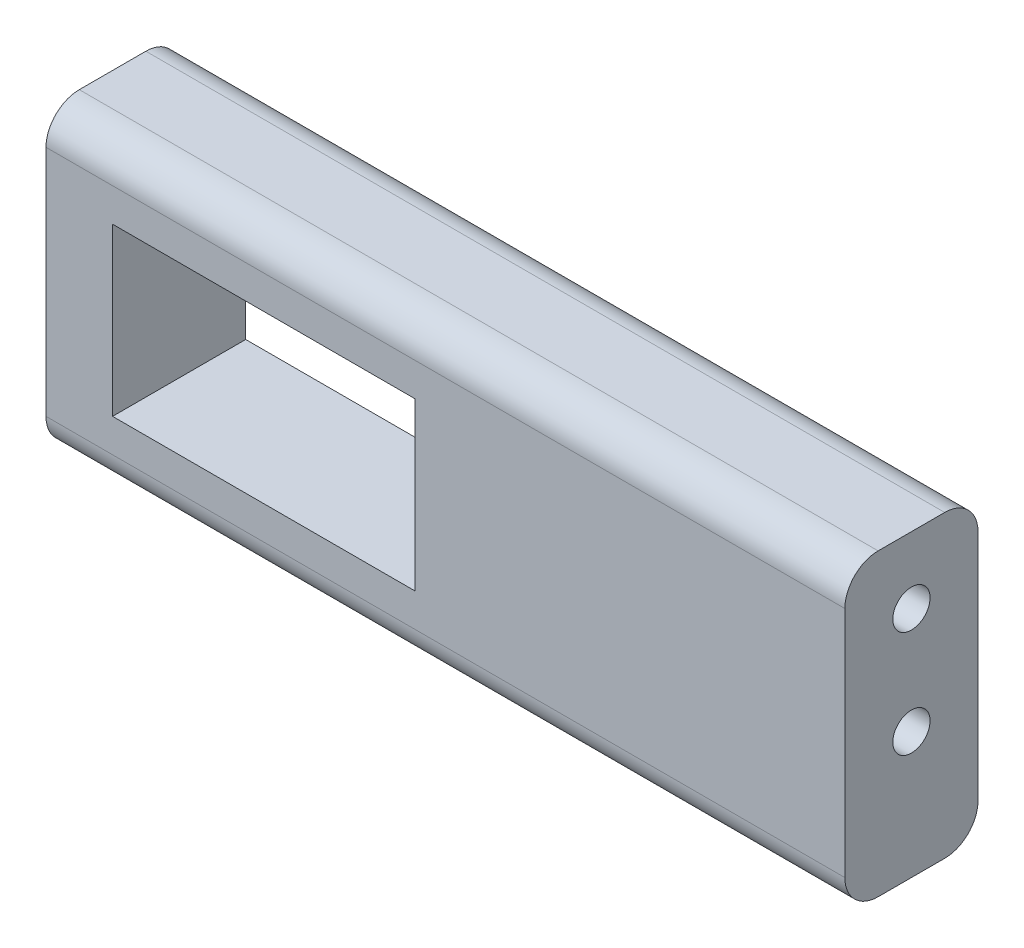
ISO-10303-21;
HEADER;
FILE_DESCRIPTION(('STEP AP214'),'2;1');
FILE_NAME('part.step','',(''),(''),'','','');
FILE_SCHEMA(('AUTOMOTIVE_DESIGN { 1 0 10303 214 1 1 1 1 }'));
ENDSEC;
DATA;
#1=APPLICATION_CONTEXT('core data for automotive mechanical design processes');
#2=APPLICATION_PROTOCOL_DEFINITION('international standard','automotive_design',2000,#1);
#3=PRODUCT_CONTEXT('',#1,'mechanical');
#4=PRODUCT('Part','Part','',(#3));
#5=PRODUCT_RELATED_PRODUCT_CATEGORY('part','',(#4));
#6=PRODUCT_DEFINITION_FORMATION('','',#4);
#7=PRODUCT_DEFINITION_CONTEXT('part definition',#1,'design');
#8=PRODUCT_DEFINITION('design','',#6,#7);
#9=PRODUCT_DEFINITION_SHAPE('','',#8);
#10=(LENGTH_UNIT() NAMED_UNIT(*) SI_UNIT(.MILLI.,.METRE.));
#11=(NAMED_UNIT(*) PLANE_ANGLE_UNIT() SI_UNIT($,.RADIAN.));
#12=(NAMED_UNIT(*) SI_UNIT($,.STERADIAN.) SOLID_ANGLE_UNIT());
#13=UNCERTAINTY_MEASURE_WITH_UNIT(LENGTH_MEASURE(1.E-05),#10,'distance_accuracy_value','');
#14=(GEOMETRIC_REPRESENTATION_CONTEXT(3) GLOBAL_UNCERTAINTY_ASSIGNED_CONTEXT((#13)) GLOBAL_UNIT_ASSIGNED_CONTEXT((#10,
#11,#12)) REPRESENTATION_CONTEXT('',''));
#15=CARTESIAN_POINT('',(0.,0.,0.));
#16=DIRECTION('',(0.,0.,1.));
#17=DIRECTION('',(1.,0.,0.));
#18=AXIS2_PLACEMENT_3D('',#15,#16,#17);
#19=CARTESIAN_POINT('',(0.,0.,10.));
#20=DIRECTION('',(0.,0.,1.));
#21=DIRECTION('',(1.,0.,0.));
#22=AXIS2_PLACEMENT_3D('',#19,#20,#21);
#23=PLANE('',#22);
#24=DIRECTION('',(0.,-1.,0.));
#25=VECTOR('',#24,1.);
#26=CARTESIAN_POINT('',(-15.2055258764608,12.7579166666667,10.));
#27=LINE('',#26,#25);
#28=CARTESIAN_POINT('',(-15.2055258764608,10.2579166666667,10.));
#29=VERTEX_POINT('',#28);
#30=CARTESIAN_POINT('',(-15.2055258764608,-7.24208333333333,10.));
#31=VERTEX_POINT('',#30);
#32=EDGE_CURVE('E167',#29,#31,#27,.T.);
#33=ORIENTED_EDGE('',*,*,#32,.T.);
#34=DIRECTION('',(1.,0.,0.));
#35=VECTOR('',#34,1.);
#36=CARTESIAN_POINT('',(44.7944741235392,-7.24208333333333,10.));
#37=LINE('',#36,#35);
#38=CARTESIAN_POINT('',(44.7944741235392,-7.24208333333333,10.));
#39=VERTEX_POINT('',#38);
#40=EDGE_CURVE('E192',#31,#39,#37,.T.);
#41=ORIENTED_EDGE('',*,*,#40,.T.);
#42=DIRECTION('',(0.,1.,0.));
#43=VECTOR('',#42,1.);
#44=CARTESIAN_POINT('',(44.7944741235392,12.7579166666667,10.));
#45=LINE('',#44,#43);
#46=CARTESIAN_POINT('',(44.7944741235392,10.2579166666667,10.));
#47=VERTEX_POINT('',#46);
#48=EDGE_CURVE('E170',#39,#47,#45,.T.);
#49=ORIENTED_EDGE('',*,*,#48,.T.);
#50=DIRECTION('',(-1.,0.,0.));
#51=VECTOR('',#50,1.);
#52=CARTESIAN_POINT('',(-15.2055258764608,10.2579166666667,10.));
#53=LINE('',#52,#51);
#54=EDGE_CURVE('E189',#47,#29,#53,.T.);
#55=ORIENTED_EDGE('',*,*,#54,.T.);
#56=EDGE_LOOP('',(#33,#41,#49,#55));
#57=FACE_BOUND('',#56,.T.);
#58=DIRECTION('',(1.,0.,0.));
#59=VECTOR('',#58,1.);
#60=CARTESIAN_POINT('',(-10.2055258764608,-4.74208333333334,10.));
#61=LINE('',#60,#59);
#62=CARTESIAN_POINT('',(-10.2055258764608,-4.74208333333334,10.));
#63=VERTEX_POINT('',#62);
#64=CARTESIAN_POINT('',(12.4944741235392,-4.74208333333333,10.));
#65=VERTEX_POINT('',#64);
#66=EDGE_CURVE('E134',#63,#65,#61,.T.);
#67=ORIENTED_EDGE('',*,*,#66,.F.);
#68=DIRECTION('',(0.,-1.,0.));
#69=VECTOR('',#68,1.);
#70=CARTESIAN_POINT('',(-10.2055258764608,7.75791666666667,10.));
#71=LINE('',#70,#69);
#72=CARTESIAN_POINT('',(-10.2055258764608,7.75791666666667,10.));
#73=VERTEX_POINT('',#72);
#74=EDGE_CURVE('E124',#73,#63,#71,.T.);
#75=ORIENTED_EDGE('',*,*,#74,.F.);
#76=DIRECTION('',(-1.,0.,0.));
#77=VECTOR('',#76,1.);
#78=CARTESIAN_POINT('',(-10.2055258764608,7.75791666666667,10.));
#79=LINE('',#78,#77);
#80=CARTESIAN_POINT('',(12.4944741235392,7.75791666666667,10.));
#81=VERTEX_POINT('',#80);
#82=EDGE_CURVE('E149',#81,#73,#79,.T.);
#83=ORIENTED_EDGE('',*,*,#82,.F.);
#84=DIRECTION('',(0.,1.,0.));
#85=VECTOR('',#84,1.);
#86=CARTESIAN_POINT('',(12.4944741235392,7.75791666666667,10.));
#87=LINE('',#86,#85);
#88=EDGE_CURVE('E147',#65,#81,#87,.T.);
#89=ORIENTED_EDGE('',*,*,#88,.F.);
#90=EDGE_LOOP('',(#67,#75,#83,#89));
#91=FACE_BOUND('',#90,.T.);
#92=ADVANCED_FACE('F33',(#57,#91),#23,.T.);
#93=CARTESIAN_POINT('',(0.,0.,0.));
#94=DIRECTION('',(0.,0.,1.));
#95=DIRECTION('',(1.,0.,0.));
#96=AXIS2_PLACEMENT_3D('',#93,#94,#95);
#97=PLANE('',#96);
#98=DIRECTION('',(0.,1.,0.));
#99=VECTOR('',#98,1.);
#100=CARTESIAN_POINT('',(44.7944741235392,12.7579166666667,0.));
#101=LINE('',#100,#99);
#102=CARTESIAN_POINT('',(44.7944741235392,-7.24208333333333,0.));
#103=VERTEX_POINT('',#102);
#104=CARTESIAN_POINT('',(44.7944741235392,10.2579166666667,0.));
#105=VERTEX_POINT('',#104);
#106=EDGE_CURVE('E171',#103,#105,#101,.T.);
#107=ORIENTED_EDGE('',*,*,#106,.F.);
#108=DIRECTION('',(1.,0.,0.));
#109=VECTOR('',#108,1.);
#110=CARTESIAN_POINT('',(0.,-7.24208333333333,0.));
#111=LINE('',#110,#109);
#112=CARTESIAN_POINT('',(-15.2055258764608,-7.24208333333333,0.));
#113=VERTEX_POINT('',#112);
#114=EDGE_CURVE('E11',#103,#113,#111,.F.);
#115=ORIENTED_EDGE('',*,*,#114,.T.);
#116=DIRECTION('',(0.,-1.,0.));
#117=VECTOR('',#116,1.);
#118=CARTESIAN_POINT('',(-15.2055258764608,12.7579166666667,0.));
#119=LINE('',#118,#117);
#120=CARTESIAN_POINT('',(-15.2055258764608,10.2579166666667,0.));
#121=VERTEX_POINT('',#120);
#122=EDGE_CURVE('E142',#121,#113,#119,.T.);
#123=ORIENTED_EDGE('',*,*,#122,.F.);
#124=DIRECTION('',(-1.,0.,0.));
#125=VECTOR('',#124,1.);
#126=CARTESIAN_POINT('',(0.,10.2579166666667,0.));
#127=LINE('',#126,#125);
#128=EDGE_CURVE('E41',#121,#105,#127,.F.);
#129=ORIENTED_EDGE('',*,*,#128,.T.);
#130=EDGE_LOOP('',(#107,#115,#123,#129));
#131=FACE_BOUND('',#130,.T.);
#132=DIRECTION('',(0.,-1.,0.));
#133=VECTOR('',#132,1.);
#134=CARTESIAN_POINT('',(-10.2055258764608,7.75791666666667,0.));
#135=LINE('',#134,#133);
#136=CARTESIAN_POINT('',(-10.2055258764608,7.75791666666667,0.));
#137=VERTEX_POINT('',#136);
#138=CARTESIAN_POINT('',(-10.2055258764608,-4.74208333333334,0.));
#139=VERTEX_POINT('',#138);
#140=EDGE_CURVE('E154',#137,#139,#135,.T.);
#141=ORIENTED_EDGE('',*,*,#140,.T.);
#142=DIRECTION('',(1.,0.,0.));
#143=VECTOR('',#142,1.);
#144=CARTESIAN_POINT('',(-10.2055258764608,-4.74208333333334,0.));
#145=LINE('',#144,#143);
#146=CARTESIAN_POINT('',(12.4944741235392,-4.74208333333333,0.));
#147=VERTEX_POINT('',#146);
#148=EDGE_CURVE('E141',#139,#147,#145,.T.);
#149=ORIENTED_EDGE('',*,*,#148,.T.);
#150=DIRECTION('',(0.,1.,0.));
#151=VECTOR('',#150,1.);
#152=CARTESIAN_POINT('',(12.4944741235392,7.75791666666667,0.));
#153=LINE('',#152,#151);
#154=CARTESIAN_POINT('',(12.4944741235392,7.75791666666667,0.));
#155=VERTEX_POINT('',#154);
#156=EDGE_CURVE('E158',#147,#155,#153,.T.);
#157=ORIENTED_EDGE('',*,*,#156,.T.);
#158=DIRECTION('',(-1.,0.,0.));
#159=VECTOR('',#158,1.);
#160=CARTESIAN_POINT('',(-10.2055258764608,7.75791666666667,0.));
#161=LINE('',#160,#159);
#162=EDGE_CURVE('E135',#155,#137,#161,.T.);
#163=ORIENTED_EDGE('',*,*,#162,.T.);
#164=EDGE_LOOP('',(#141,#149,#157,#163));
#165=FACE_BOUND('',#164,.T.);
#166=ADVANCED_FACE('F220',(#131,#165),#97,.F.);
#167=CARTESIAN_POINT('',(-15.2055258764608,12.7579166666667,10.));
#168=DIRECTION('',(1.,0.,0.));
#169=DIRECTION('',(0.,1.,0.));
#170=AXIS2_PLACEMENT_3D('',#167,#168,#169);
#171=PLANE('',#170);
#172=CARTESIAN_POINT('',(-15.2055258764608,-0.242083333333333,5.));
#173=DIRECTION('',(-1.,0.,0.));
#174=DIRECTION('',(0.,-1.,0.));
#175=AXIS2_PLACEMENT_3D('',#172,#173,#174);
#176=CIRCLE('',#175,1.4);
#177=CARTESIAN_POINT('',(-15.2055258764608,-1.64208333333333,5.));
#178=VERTEX_POINT('',#177);
#179=EDGE_CURVE('E281',#178,#178,#176,.T.);
#180=ORIENTED_EDGE('',*,*,#179,.F.);
#181=EDGE_LOOP('',(#180));
#182=FACE_BOUND('',#181,.T.);
#183=CARTESIAN_POINT('',(-15.2055258764608,7.75791666666667,5.));
#184=DIRECTION('',(-1.,0.,0.));
#185=DIRECTION('',(0.,-1.,0.));
#186=AXIS2_PLACEMENT_3D('',#183,#184,#185);
#187=CIRCLE('',#186,1.4);
#188=CARTESIAN_POINT('',(-15.2055258764608,6.35791666666667,5.));
#189=VERTEX_POINT('',#188);
#190=EDGE_CURVE('E284',#189,#189,#187,.T.);
#191=ORIENTED_EDGE('',*,*,#190,.F.);
#192=EDGE_LOOP('',(#191));
#193=FACE_BOUND('',#192,.T.);
#194=DIRECTION('',(0.,0.,-1.));
#195=VECTOR('',#194,1.);
#196=CARTESIAN_POINT('',(-15.2055258764608,-9.74208333333334,10.));
#197=LINE('',#196,#195);
#198=CARTESIAN_POINT('',(-15.2055258764608,-9.74208333333334,7.5));
#199=VERTEX_POINT('',#198);
#200=CARTESIAN_POINT('',(-15.2055258764608,-9.74208333333334,2.5));
#201=VERTEX_POINT('',#200);
#202=EDGE_CURVE('E186',#199,#201,#197,.T.);
#203=ORIENTED_EDGE('',*,*,#202,.F.);
#204=CARTESIAN_POINT('',(-15.2055258764608,-7.24208333333333,7.5));
#205=DIRECTION('',(1.,0.,0.));
#206=DIRECTION('',(0.,1.,0.));
#207=AXIS2_PLACEMENT_3D('',#204,#205,#206);
#208=CIRCLE('',#207,2.5);
#209=EDGE_CURVE('E212',#199,#31,#208,.F.);
#210=ORIENTED_EDGE('',*,*,#209,.T.);
#211=ORIENTED_EDGE('',*,*,#32,.F.);
#212=CARTESIAN_POINT('',(-15.2055258764608,10.2579166666667,7.5));
#213=DIRECTION('',(1.,0.,0.));
#214=DIRECTION('',(0.,1.,0.));
#215=AXIS2_PLACEMENT_3D('',#212,#213,#214);
#216=CIRCLE('',#215,2.5);
#217=CARTESIAN_POINT('',(-15.2055258764608,12.7579166666667,7.5));
#218=VERTEX_POINT('',#217);
#219=EDGE_CURVE('E56',#29,#218,#216,.F.);
#220=ORIENTED_EDGE('',*,*,#219,.T.);
#221=DIRECTION('',(0.,0.,-1.));
#222=VECTOR('',#221,1.);
#223=CARTESIAN_POINT('',(-15.2055258764608,12.7579166666667,10.));
#224=LINE('',#223,#222);
#225=CARTESIAN_POINT('',(-15.2055258764608,12.7579166666667,2.5));
#226=VERTEX_POINT('',#225);
#227=EDGE_CURVE('E174',#218,#226,#224,.T.);
#228=ORIENTED_EDGE('',*,*,#227,.T.);
#229=CARTESIAN_POINT('',(-15.2055258764608,10.2579166666667,2.5));
#230=DIRECTION('',(1.,0.,0.));
#231=DIRECTION('',(0.,1.,0.));
#232=AXIS2_PLACEMENT_3D('',#229,#230,#231);
#233=CIRCLE('',#232,2.5);
#234=EDGE_CURVE('E48',#226,#121,#233,.F.);
#235=ORIENTED_EDGE('',*,*,#234,.T.);
#236=ORIENTED_EDGE('',*,*,#122,.T.);
#237=CARTESIAN_POINT('',(-15.2055258764608,-7.24208333333333,2.5));
#238=DIRECTION('',(1.,0.,0.));
#239=DIRECTION('',(0.,1.,0.));
#240=AXIS2_PLACEMENT_3D('',#237,#238,#239);
#241=CIRCLE('',#240,2.5);
#242=EDGE_CURVE('E209',#113,#201,#241,.F.);
#243=ORIENTED_EDGE('',*,*,#242,.T.);
#244=EDGE_LOOP('',(#203,#210,#211,#220,#228,#235,#236,#243));
#245=FACE_BOUND('',#244,.T.);
#246=ADVANCED_FACE('F232',(#182,#193,#245),#171,.F.);
#247=CARTESIAN_POINT('',(-15.2055258764608,-9.74208333333334,10.));
#248=DIRECTION('',(0.,1.,0.));
#249=DIRECTION('',(0.,0.,1.));
#250=AXIS2_PLACEMENT_3D('',#247,#248,#249);
#251=PLANE('',#250);
#252=DIRECTION('',(0.,0.,-1.));
#253=VECTOR('',#252,1.);
#254=CARTESIAN_POINT('',(44.7944741235392,-9.74208333333334,10.));
#255=LINE('',#254,#253);
#256=CARTESIAN_POINT('',(44.7944741235392,-9.74208333333334,7.5));
#257=VERTEX_POINT('',#256);
#258=CARTESIAN_POINT('',(44.7944741235392,-9.74208333333334,2.5));
#259=VERTEX_POINT('',#258);
#260=EDGE_CURVE('E183',#257,#259,#255,.T.);
#261=ORIENTED_EDGE('',*,*,#260,.F.);
#262=DIRECTION('',(1.,0.,0.));
#263=VECTOR('',#262,1.);
#264=CARTESIAN_POINT('',(-15.2055258764608,-9.74208333333334,7.5));
#265=LINE('',#264,#263);
#266=EDGE_CURVE('E206',#257,#199,#265,.F.);
#267=ORIENTED_EDGE('',*,*,#266,.T.);
#268=ORIENTED_EDGE('',*,*,#202,.T.);
#269=DIRECTION('',(1.,0.,0.));
#270=VECTOR('',#269,1.);
#271=CARTESIAN_POINT('',(-15.2055258764608,-9.74208333333334,2.5));
#272=LINE('',#271,#270);
#273=EDGE_CURVE('E203',#201,#259,#272,.T.);
#274=ORIENTED_EDGE('',*,*,#273,.T.);
#275=EDGE_LOOP('',(#261,#267,#268,#274));
#276=FACE_BOUND('',#275,.T.);
#277=ADVANCED_FACE('F239',(#276),#251,.F.);
#278=CARTESIAN_POINT('',(44.7944741235392,12.7579166666667,10.));
#279=DIRECTION('',(-1.,0.,0.));
#280=DIRECTION('',(0.,0.,1.));
#281=AXIS2_PLACEMENT_3D('',#278,#279,#280);
#282=PLANE('',#281);
#283=CARTESIAN_POINT('',(44.7944741235392,-0.242083333333333,5.));
#284=DIRECTION('',(1.,0.,0.));
#285=DIRECTION('',(0.,0.,-1.));
#286=AXIS2_PLACEMENT_3D('',#283,#284,#285);
#287=CIRCLE('',#286,1.4);
#288=CARTESIAN_POINT('',(44.7944741235392,-0.242083333333333,3.6));
#289=VERTEX_POINT('',#288);
#290=EDGE_CURVE('E290',#289,#289,#287,.T.);
#291=ORIENTED_EDGE('',*,*,#290,.F.);
#292=EDGE_LOOP('',(#291));
#293=FACE_BOUND('',#292,.T.);
#294=CARTESIAN_POINT('',(44.7944741235392,7.75791666666667,5.));
#295=DIRECTION('',(1.,0.,0.));
#296=DIRECTION('',(0.,0.,-1.));
#297=AXIS2_PLACEMENT_3D('',#294,#295,#296);
#298=CIRCLE('',#297,1.4);
#299=CARTESIAN_POINT('',(44.7944741235392,7.75791666666667,3.6));
#300=VERTEX_POINT('',#299);
#301=EDGE_CURVE('E299',#300,#300,#298,.T.);
#302=ORIENTED_EDGE('',*,*,#301,.F.);
#303=EDGE_LOOP('',(#302));
#304=FACE_BOUND('',#303,.T.);
#305=ORIENTED_EDGE('',*,*,#48,.F.);
#306=CARTESIAN_POINT('',(44.7944741235392,-7.24208333333333,7.5));
#307=DIRECTION('',(-1.,0.,0.));
#308=DIRECTION('',(0.,0.,1.));
#309=AXIS2_PLACEMENT_3D('',#306,#307,#308);
#310=CIRCLE('',#309,2.5);
#311=EDGE_CURVE('E201',#39,#257,#310,.F.);
#312=ORIENTED_EDGE('',*,*,#311,.T.);
#313=ORIENTED_EDGE('',*,*,#260,.T.);
#314=CARTESIAN_POINT('',(44.7944741235392,-7.24208333333333,2.5));
#315=DIRECTION('',(-1.,0.,0.));
#316=DIRECTION('',(0.,0.,1.));
#317=AXIS2_PLACEMENT_3D('',#314,#315,#316);
#318=CIRCLE('',#317,2.5);
#319=EDGE_CURVE('E197',#259,#103,#318,.F.);
#320=ORIENTED_EDGE('',*,*,#319,.T.);
#321=ORIENTED_EDGE('',*,*,#106,.T.);
#322=CARTESIAN_POINT('',(44.7944741235392,10.2579166666667,2.5));
#323=DIRECTION('',(-1.,0.,0.));
#324=DIRECTION('',(0.,0.,1.));
#325=AXIS2_PLACEMENT_3D('',#322,#323,#324);
#326=CIRCLE('',#325,2.5);
#327=CARTESIAN_POINT('',(44.7944741235392,12.7579166666667,2.5));
#328=VERTEX_POINT('',#327);
#329=EDGE_CURVE('E195',#105,#328,#326,.F.);
#330=ORIENTED_EDGE('',*,*,#329,.T.);
#331=DIRECTION('',(0.,0.,-1.));
#332=VECTOR('',#331,1.);
#333=CARTESIAN_POINT('',(44.7944741235392,12.7579166666667,10.));
#334=LINE('',#333,#332);
#335=CARTESIAN_POINT('',(44.7944741235392,12.7579166666667,7.5));
#336=VERTEX_POINT('',#335);
#337=EDGE_CURVE('E180',#336,#328,#334,.T.);
#338=ORIENTED_EDGE('',*,*,#337,.F.);
#339=CARTESIAN_POINT('',(44.7944741235392,10.2579166666667,7.5));
#340=DIRECTION('',(-1.,0.,0.));
#341=DIRECTION('',(0.,0.,1.));
#342=AXIS2_PLACEMENT_3D('',#339,#340,#341);
#343=CIRCLE('',#342,2.5);
#344=EDGE_CURVE('E199',#336,#47,#343,.F.);
#345=ORIENTED_EDGE('',*,*,#344,.T.);
#346=EDGE_LOOP('',(#305,#312,#313,#320,#321,#330,#338,#345));
#347=FACE_BOUND('',#346,.T.);
#348=ADVANCED_FACE('F226',(#293,#304,#347),#282,.F.);
#349=CARTESIAN_POINT('',(-15.2055258764608,12.7579166666667,10.));
#350=DIRECTION('',(0.,-1.,0.));
#351=DIRECTION('',(0.,0.,-1.));
#352=AXIS2_PLACEMENT_3D('',#349,#350,#351);
#353=PLANE('',#352);
#354=ORIENTED_EDGE('',*,*,#227,.F.);
#355=DIRECTION('',(-1.,0.,0.));
#356=VECTOR('',#355,1.);
#357=CARTESIAN_POINT('',(44.7944741235392,12.7579166666667,7.5));
#358=LINE('',#357,#356);
#359=EDGE_CURVE('E216',#218,#336,#358,.F.);
#360=ORIENTED_EDGE('',*,*,#359,.T.);
#361=ORIENTED_EDGE('',*,*,#337,.T.);
#362=DIRECTION('',(-1.,0.,0.));
#363=VECTOR('',#362,1.);
#364=CARTESIAN_POINT('',(-15.2055258764608,12.7579166666667,2.5));
#365=LINE('',#364,#363);
#366=EDGE_CURVE('E214',#328,#226,#365,.T.);
#367=ORIENTED_EDGE('',*,*,#366,.T.);
#368=EDGE_LOOP('',(#354,#360,#361,#367));
#369=FACE_BOUND('',#368,.T.);
#370=ADVANCED_FACE('F229',(#369),#353,.F.);
#371=CARTESIAN_POINT('',(-10.2055258764608,7.75791666666667,10.));
#372=DIRECTION('',(1.,0.,0.));
#373=DIRECTION('',(0.,1.,0.));
#374=AXIS2_PLACEMENT_3D('',#371,#372,#373);
#375=PLANE('',#374);
#376=ORIENTED_EDGE('',*,*,#140,.F.);
#377=DIRECTION('',(0.,0.,-1.));
#378=VECTOR('',#377,1.);
#379=CARTESIAN_POINT('',(-10.2055258764608,7.75791666666667,10.));
#380=LINE('',#379,#378);
#381=EDGE_CURVE('E130',#73,#137,#380,.T.);
#382=ORIENTED_EDGE('',*,*,#381,.F.);
#383=ORIENTED_EDGE('',*,*,#74,.T.);
#384=DIRECTION('',(0.,0.,-1.));
#385=VECTOR('',#384,1.);
#386=CARTESIAN_POINT('',(-10.2055258764608,-4.74208333333334,10.));
#387=LINE('',#386,#385);
#388=EDGE_CURVE('E127',#63,#139,#387,.T.);
#389=ORIENTED_EDGE('',*,*,#388,.T.);
#390=EDGE_LOOP('',(#376,#382,#383,#389));
#391=FACE_BOUND('',#390,.T.);
#392=ADVANCED_FACE('F126',(#391),#375,.T.);
#393=CARTESIAN_POINT('',(-10.2055258764608,-4.74208333333334,10.));
#394=DIRECTION('',(0.,1.,0.));
#395=DIRECTION('',(-1.,0.,0.));
#396=AXIS2_PLACEMENT_3D('',#393,#394,#395);
#397=PLANE('',#396);
#398=ORIENTED_EDGE('',*,*,#148,.F.);
#399=ORIENTED_EDGE('',*,*,#388,.F.);
#400=ORIENTED_EDGE('',*,*,#66,.T.);
#401=DIRECTION('',(0.,0.,-1.));
#402=VECTOR('',#401,1.);
#403=CARTESIAN_POINT('',(12.4944741235392,-4.74208333333333,10.));
#404=LINE('',#403,#402);
#405=EDGE_CURVE('E143',#65,#147,#404,.T.);
#406=ORIENTED_EDGE('',*,*,#405,.T.);
#407=EDGE_LOOP('',(#398,#399,#400,#406));
#408=FACE_BOUND('',#407,.T.);
#409=ADVANCED_FACE('F138',(#408),#397,.T.);
#410=CARTESIAN_POINT('',(12.4944741235392,7.75791666666667,10.));
#411=DIRECTION('',(-1.,0.,0.));
#412=DIRECTION('',(0.,-1.,0.));
#413=AXIS2_PLACEMENT_3D('',#410,#411,#412);
#414=PLANE('',#413);
#415=ORIENTED_EDGE('',*,*,#156,.F.);
#416=ORIENTED_EDGE('',*,*,#405,.F.);
#417=ORIENTED_EDGE('',*,*,#88,.T.);
#418=DIRECTION('',(0.,0.,-1.));
#419=VECTOR('',#418,1.);
#420=CARTESIAN_POINT('',(12.4944741235392,7.75791666666667,10.));
#421=LINE('',#420,#419);
#422=EDGE_CURVE('E164',#81,#155,#421,.T.);
#423=ORIENTED_EDGE('',*,*,#422,.T.);
#424=EDGE_LOOP('',(#415,#416,#417,#423));
#425=FACE_BOUND('',#424,.T.);
#426=ADVANCED_FACE('F320',(#425),#414,.T.);
#427=CARTESIAN_POINT('',(-10.2055258764608,7.75791666666667,10.));
#428=DIRECTION('',(0.,-1.,0.));
#429=DIRECTION('',(1.,0.,0.));
#430=AXIS2_PLACEMENT_3D('',#427,#428,#429);
#431=PLANE('',#430);
#432=ORIENTED_EDGE('',*,*,#162,.F.);
#433=ORIENTED_EDGE('',*,*,#422,.F.);
#434=ORIENTED_EDGE('',*,*,#82,.T.);
#435=ORIENTED_EDGE('',*,*,#381,.T.);
#436=EDGE_LOOP('',(#432,#433,#434,#435));
#437=FACE_BOUND('',#436,.T.);
#438=ADVANCED_FACE('F310',(#437),#431,.T.);
#439=CARTESIAN_POINT('',(24.7944741235392,7.75791666666667,5.));
#440=DIRECTION('',(1.,0.,0.));
#441=DIRECTION('',(0.,0.,-1.));
#442=AXIS2_PLACEMENT_3D('',#439,#440,#441);
#443=CYLINDRICAL_SURFACE('',#442,1.4);
#444=CARTESIAN_POINT('',(24.7944741235392,7.75791666666667,5.));
#445=DIRECTION('',(1.,0.,0.));
#446=DIRECTION('',(0.,0.,-1.));
#447=AXIS2_PLACEMENT_3D('',#444,#445,#446);
#448=CIRCLE('',#447,1.4);
#449=CARTESIAN_POINT('',(24.7944741235392,7.75791666666667,3.6));
#450=VERTEX_POINT('',#449);
#451=EDGE_CURVE('E156',#450,#450,#448,.T.);
#452=ORIENTED_EDGE('',*,*,#451,.F.);
#453=EDGE_LOOP('',(#452));
#454=FACE_BOUND('',#453,.T.);
#455=ORIENTED_EDGE('',*,*,#301,.T.);
#456=EDGE_LOOP('',(#455));
#457=FACE_BOUND('',#456,.T.);
#458=ADVANCED_FACE('F306',(#454,#457),#443,.F.);
#459=CARTESIAN_POINT('',(24.7944741235392,7.75791666666667,5.));
#460=DIRECTION('',(1.,0.,0.));
#461=DIRECTION('',(0.,0.,-1.));
#462=AXIS2_PLACEMENT_3D('',#459,#460,#461);
#463=PLANE('',#462);
#464=ORIENTED_EDGE('',*,*,#451,.T.);
#465=EDGE_LOOP('',(#464));
#466=FACE_BOUND('',#465,.T.);
#467=ADVANCED_FACE('F309',(#466),#463,.T.);
#468=CARTESIAN_POINT('',(24.7944741235392,-0.242083333333333,5.));
#469=DIRECTION('',(1.,0.,0.));
#470=DIRECTION('',(0.,0.,-1.));
#471=AXIS2_PLACEMENT_3D('',#468,#469,#470);
#472=CYLINDRICAL_SURFACE('',#471,1.4);
#473=CARTESIAN_POINT('',(24.7944741235392,-0.242083333333333,5.));
#474=DIRECTION('',(1.,0.,0.));
#475=DIRECTION('',(0.,0.,-1.));
#476=AXIS2_PLACEMENT_3D('',#473,#474,#475);
#477=CIRCLE('',#476,1.4);
#478=CARTESIAN_POINT('',(24.7944741235392,-0.242083333333333,3.6));
#479=VERTEX_POINT('',#478);
#480=EDGE_CURVE('E296',#479,#479,#477,.T.);
#481=ORIENTED_EDGE('',*,*,#480,.F.);
#482=EDGE_LOOP('',(#481));
#483=FACE_BOUND('',#482,.T.);
#484=ORIENTED_EDGE('',*,*,#290,.T.);
#485=EDGE_LOOP('',(#484));
#486=FACE_BOUND('',#485,.T.);
#487=ADVANCED_FACE('F317',(#483,#486),#472,.F.);
#488=CARTESIAN_POINT('',(24.7944741235392,-0.242083333333333,5.));
#489=DIRECTION('',(1.,0.,0.));
#490=DIRECTION('',(0.,0.,-1.));
#491=AXIS2_PLACEMENT_3D('',#488,#489,#490);
#492=PLANE('',#491);
#493=ORIENTED_EDGE('',*,*,#480,.T.);
#494=EDGE_LOOP('',(#493));
#495=FACE_BOUND('',#494,.T.);
#496=ADVANCED_FACE('F401',(#495),#492,.T.);
#497=CARTESIAN_POINT('',(-12.2055258764608,7.75791666666667,5.));
#498=DIRECTION('',(-1.,0.,0.));
#499=DIRECTION('',(0.,-1.,0.));
#500=AXIS2_PLACEMENT_3D('',#497,#498,#499);
#501=CYLINDRICAL_SURFACE('',#500,1.4);
#502=CARTESIAN_POINT('',(-12.2055258764608,7.75791666666667,5.));
#503=DIRECTION('',(-1.,0.,0.));
#504=DIRECTION('',(0.,-1.,0.));
#505=AXIS2_PLACEMENT_3D('',#502,#503,#504);
#506=CIRCLE('',#505,1.4);
#507=CARTESIAN_POINT('',(-12.2055258764608,6.35791666666667,5.));
#508=VERTEX_POINT('',#507);
#509=EDGE_CURVE('E286',#508,#508,#506,.T.);
#510=ORIENTED_EDGE('',*,*,#509,.F.);
#511=EDGE_LOOP('',(#510));
#512=FACE_BOUND('',#511,.T.);
#513=ORIENTED_EDGE('',*,*,#190,.T.);
#514=EDGE_LOOP('',(#513));
#515=FACE_BOUND('',#514,.T.);
#516=ADVANCED_FACE('F391',(#512,#515),#501,.F.);
#517=CARTESIAN_POINT('',(-12.2055258764608,7.75791666666667,5.));
#518=DIRECTION('',(-1.,0.,0.));
#519=DIRECTION('',(0.,-1.,0.));
#520=AXIS2_PLACEMENT_3D('',#517,#518,#519);
#521=PLANE('',#520);
#522=ORIENTED_EDGE('',*,*,#509,.T.);
#523=EDGE_LOOP('',(#522));
#524=FACE_BOUND('',#523,.T.);
#525=ADVANCED_FACE('F381',(#524),#521,.T.);
#526=CARTESIAN_POINT('',(-12.2055258764608,-0.242083333333333,5.));
#527=DIRECTION('',(-1.,0.,0.));
#528=DIRECTION('',(0.,-1.,0.));
#529=AXIS2_PLACEMENT_3D('',#526,#527,#528);
#530=CYLINDRICAL_SURFACE('',#529,1.4);
#531=CARTESIAN_POINT('',(-12.2055258764608,-0.242083333333333,5.));
#532=DIRECTION('',(-1.,0.,0.));
#533=DIRECTION('',(0.,-1.,0.));
#534=AXIS2_PLACEMENT_3D('',#531,#532,#533);
#535=CIRCLE('',#534,1.4);
#536=CARTESIAN_POINT('',(-12.2055258764608,-1.64208333333333,5.));
#537=VERTEX_POINT('',#536);
#538=EDGE_CURVE('E287',#537,#537,#535,.T.);
#539=ORIENTED_EDGE('',*,*,#538,.F.);
#540=EDGE_LOOP('',(#539));
#541=FACE_BOUND('',#540,.T.);
#542=ORIENTED_EDGE('',*,*,#179,.T.);
#543=EDGE_LOOP('',(#542));
#544=FACE_BOUND('',#543,.T.);
#545=ADVANCED_FACE('F370',(#541,#544),#530,.F.);
#546=CARTESIAN_POINT('',(-12.2055258764608,-0.242083333333333,5.));
#547=DIRECTION('',(-1.,0.,0.));
#548=DIRECTION('',(0.,-1.,0.));
#549=AXIS2_PLACEMENT_3D('',#546,#547,#548);
#550=PLANE('',#549);
#551=ORIENTED_EDGE('',*,*,#538,.T.);
#552=EDGE_LOOP('',(#551));
#553=FACE_BOUND('',#552,.T.);
#554=ADVANCED_FACE('F256',(#553),#550,.T.);
#555=CARTESIAN_POINT('',(0.,-7.24208333333333,7.5));
#556=DIRECTION('',(-1.,0.,0.));
#557=DIRECTION('',(0.,0.,1.));
#558=AXIS2_PLACEMENT_3D('',#555,#556,#557);
#559=CYLINDRICAL_SURFACE('',#558,2.5);
#560=ORIENTED_EDGE('',*,*,#209,.F.);
#561=ORIENTED_EDGE('',*,*,#266,.F.);
#562=ORIENTED_EDGE('',*,*,#311,.F.);
#563=ORIENTED_EDGE('',*,*,#40,.F.);
#564=EDGE_LOOP('',(#560,#561,#562,#563));
#565=FACE_BOUND('',#564,.T.);
#566=ADVANCED_FACE('F244',(#565),#559,.T.);
#567=CARTESIAN_POINT('',(0.,10.2579166666667,7.5));
#568=DIRECTION('',(1.,0.,0.));
#569=DIRECTION('',(0.,0.,-1.));
#570=AXIS2_PLACEMENT_3D('',#567,#568,#569);
#571=CYLINDRICAL_SURFACE('',#570,2.5);
#572=ORIENTED_EDGE('',*,*,#344,.F.);
#573=ORIENTED_EDGE('',*,*,#359,.F.);
#574=ORIENTED_EDGE('',*,*,#219,.F.);
#575=ORIENTED_EDGE('',*,*,#54,.F.);
#576=EDGE_LOOP('',(#572,#573,#574,#575));
#577=FACE_BOUND('',#576,.T.);
#578=ADVANCED_FACE('F249',(#577),#571,.T.);
#579=CARTESIAN_POINT('',(-15.2055258764608,-7.24208333333333,2.5));
#580=DIRECTION('',(1.,0.,0.));
#581=DIRECTION('',(0.,0.,-1.));
#582=AXIS2_PLACEMENT_3D('',#579,#580,#581);
#583=CYLINDRICAL_SURFACE('',#582,2.5);
#584=ORIENTED_EDGE('',*,*,#242,.F.);
#585=ORIENTED_EDGE('',*,*,#114,.F.);
#586=ORIENTED_EDGE('',*,*,#319,.F.);
#587=ORIENTED_EDGE('',*,*,#273,.F.);
#588=EDGE_LOOP('',(#584,#585,#586,#587));
#589=FACE_BOUND('',#588,.T.);
#590=ADVANCED_FACE('F236',(#589),#583,.T.);
#591=CARTESIAN_POINT('',(-15.2055258764608,10.2579166666667,2.5));
#592=DIRECTION('',(-1.,0.,0.));
#593=DIRECTION('',(0.,0.,1.));
#594=AXIS2_PLACEMENT_3D('',#591,#592,#593);
#595=CYLINDRICAL_SURFACE('',#594,2.5);
#596=ORIENTED_EDGE('',*,*,#329,.F.);
#597=ORIENTED_EDGE('',*,*,#128,.F.);
#598=ORIENTED_EDGE('',*,*,#234,.F.);
#599=ORIENTED_EDGE('',*,*,#366,.F.);
#600=EDGE_LOOP('',(#596,#597,#598,#599));
#601=FACE_BOUND('',#600,.T.);
#602=ADVANCED_FACE('F35',(#601),#595,.T.);
#603=CLOSED_SHELL('',(#92,#166,#246,#277,#348,#370,#392,#409,#426,#438,#458,#467,#487,#496,#516,
#525,#545,#554,#566,#578,#590,#602));
#604=MANIFOLD_SOLID_BREP('B2',#603);
#605=ADVANCED_BREP_SHAPE_REPRESENTATION('',(#18,#604),#14);
#606=SHAPE_DEFINITION_REPRESENTATION(#9,#605);
ENDSEC;
END-ISO-10303-21;
